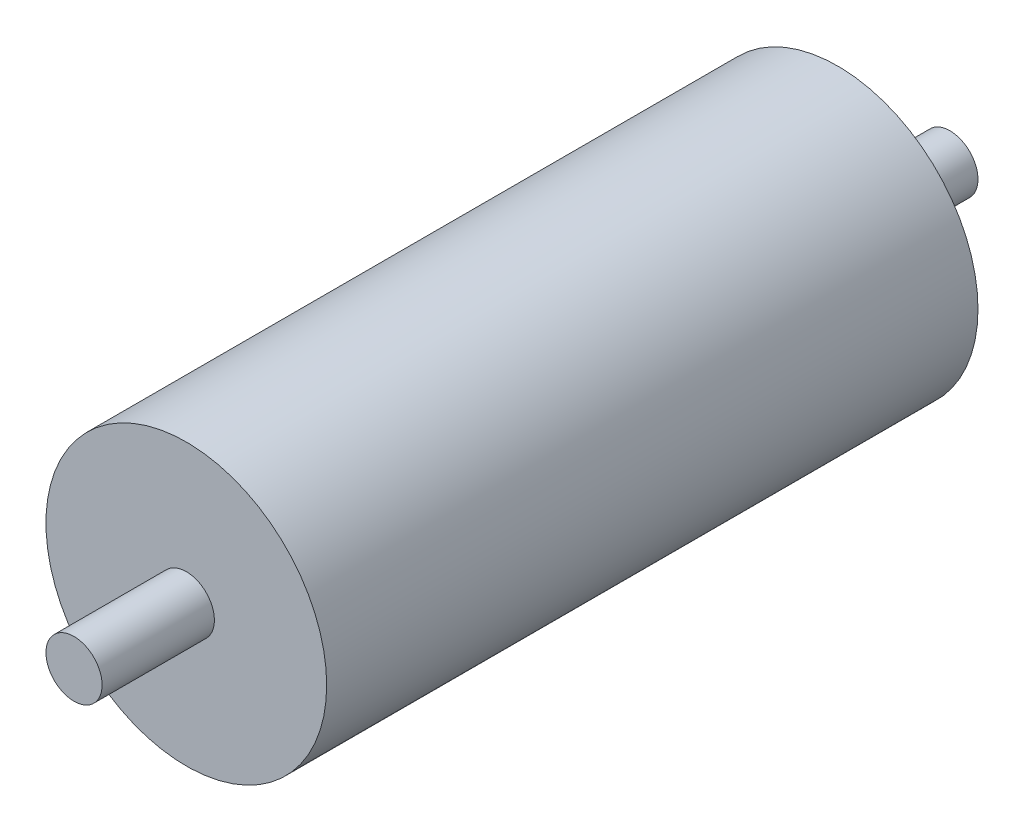
ISO-10303-21;
HEADER;
FILE_DESCRIPTION(('STEP AP214'),'2;1');
FILE_NAME('part.step','',(''),(''),'','','');
FILE_SCHEMA(('AUTOMOTIVE_DESIGN { 1 0 10303 214 1 1 1 1 }'));
ENDSEC;
DATA;
#1=APPLICATION_CONTEXT('core data for automotive mechanical design processes');
#2=APPLICATION_PROTOCOL_DEFINITION('international standard','automotive_design',2000,#1);
#3=PRODUCT_CONTEXT('',#1,'mechanical');
#4=PRODUCT('Part','Part','',(#3));
#5=PRODUCT_RELATED_PRODUCT_CATEGORY('part','',(#4));
#6=PRODUCT_DEFINITION_FORMATION('','',#4);
#7=PRODUCT_DEFINITION_CONTEXT('part definition',#1,'design');
#8=PRODUCT_DEFINITION('design','',#6,#7);
#9=PRODUCT_DEFINITION_SHAPE('','',#8);
#10=(LENGTH_UNIT() NAMED_UNIT(*) SI_UNIT(.MILLI.,.METRE.));
#11=(NAMED_UNIT(*) PLANE_ANGLE_UNIT() SI_UNIT($,.RADIAN.));
#12=(NAMED_UNIT(*) SI_UNIT($,.STERADIAN.) SOLID_ANGLE_UNIT());
#13=UNCERTAINTY_MEASURE_WITH_UNIT(LENGTH_MEASURE(1.E-05),#10,'distance_accuracy_value','');
#14=(GEOMETRIC_REPRESENTATION_CONTEXT(3) GLOBAL_UNCERTAINTY_ASSIGNED_CONTEXT((#13)) GLOBAL_UNIT_ASSIGNED_CONTEXT((#10,
#11,#12)) REPRESENTATION_CONTEXT('',''));
#15=CARTESIAN_POINT('',(0.,0.,0.));
#16=DIRECTION('',(0.,0.,1.));
#17=DIRECTION('',(1.,0.,0.));
#18=AXIS2_PLACEMENT_3D('',#15,#16,#17);
#19=CARTESIAN_POINT('',(0.,0.,58.));
#20=DIRECTION('',(0.,0.,-1.));
#21=DIRECTION('',(-1.,0.,0.));
#22=AXIS2_PLACEMENT_3D('',#19,#20,#21);
#23=CYLINDRICAL_SURFACE('',#22,12.5);
#24=CARTESIAN_POINT('',(0.,0.,58.));
#25=DIRECTION('',(0.,0.,1.));
#26=DIRECTION('',(1.,0.,0.));
#27=AXIS2_PLACEMENT_3D('',#24,#25,#26);
#28=CIRCLE('',#27,12.5);
#29=CARTESIAN_POINT('',(12.5,0.,58.));
#30=VERTEX_POINT('',#29);
#31=EDGE_CURVE('E43',#30,#30,#28,.T.);
#32=ORIENTED_EDGE('',*,*,#31,.F.);
#33=EDGE_LOOP('',(#32));
#34=FACE_BOUND('',#33,.T.);
#35=CARTESIAN_POINT('',(0.,0.,0.));
#36=DIRECTION('',(0.,0.,1.));
#37=DIRECTION('',(1.,0.,0.));
#38=AXIS2_PLACEMENT_3D('',#35,#36,#37);
#39=CIRCLE('',#38,12.5);
#40=CARTESIAN_POINT('',(12.5,0.,0.));
#41=VERTEX_POINT('',#40);
#42=EDGE_CURVE('E34',#41,#41,#39,.T.);
#43=ORIENTED_EDGE('',*,*,#42,.T.);
#44=EDGE_LOOP('',(#43));
#45=FACE_BOUND('',#44,.T.);
#46=ADVANCED_FACE('F31',(#34,#45),#23,.T.);
#47=CARTESIAN_POINT('',(0.,0.,58.));
#48=DIRECTION('',(0.,0.,1.));
#49=DIRECTION('',(1.,0.,0.));
#50=AXIS2_PLACEMENT_3D('',#47,#48,#49);
#51=PLANE('',#50);
#52=CARTESIAN_POINT('',(0.,0.,58.));
#53=DIRECTION('',(0.,0.,1.));
#54=DIRECTION('',(1.,0.,0.));
#55=AXIS2_PLACEMENT_3D('',#52,#53,#54);
#56=CIRCLE('',#55,2.5);
#57=CARTESIAN_POINT('',(2.5,0.,58.));
#58=VERTEX_POINT('',#57);
#59=EDGE_CURVE('E38',#58,#58,#56,.T.);
#60=ORIENTED_EDGE('',*,*,#59,.F.);
#61=EDGE_LOOP('',(#60));
#62=FACE_BOUND('',#61,.T.);
#63=ORIENTED_EDGE('',*,*,#31,.T.);
#64=EDGE_LOOP('',(#63));
#65=FACE_BOUND('',#64,.T.);
#66=ADVANCED_FACE('F60',(#62,#65),#51,.T.);
#67=CARTESIAN_POINT('',(0.,0.,0.));
#68=DIRECTION('',(0.,0.,1.));
#69=DIRECTION('',(1.,0.,0.));
#70=AXIS2_PLACEMENT_3D('',#67,#68,#69);
#71=PLANE('',#70);
#72=CARTESIAN_POINT('',(0.,0.,0.));
#73=DIRECTION('',(0.,0.,-1.));
#74=DIRECTION('',(-1.,0.,0.));
#75=AXIS2_PLACEMENT_3D('',#72,#73,#74);
#76=CIRCLE('',#75,2.5);
#77=CARTESIAN_POINT('',(-2.5,0.,0.));
#78=VERTEX_POINT('',#77);
#79=EDGE_CURVE('E10',#78,#78,#76,.T.);
#80=ORIENTED_EDGE('',*,*,#79,.F.);
#81=EDGE_LOOP('',(#80));
#82=FACE_BOUND('',#81,.T.);
#83=ORIENTED_EDGE('',*,*,#42,.F.);
#84=EDGE_LOOP('',(#83));
#85=FACE_BOUND('',#84,.T.);
#86=ADVANCED_FACE('F57',(#82,#85),#71,.F.);
#87=CARTESIAN_POINT('',(0.,0.,68.));
#88=DIRECTION('',(0.,0.,-1.));
#89=DIRECTION('',(-1.,0.,0.));
#90=AXIS2_PLACEMENT_3D('',#87,#88,#89);
#91=CYLINDRICAL_SURFACE('',#90,2.5);
#92=CARTESIAN_POINT('',(0.,0.,68.));
#93=DIRECTION('',(0.,0.,1.));
#94=DIRECTION('',(1.,0.,0.));
#95=AXIS2_PLACEMENT_3D('',#92,#93,#94);
#96=CIRCLE('',#95,2.5);
#97=CARTESIAN_POINT('',(2.5,0.,68.));
#98=VERTEX_POINT('',#97);
#99=EDGE_CURVE('E48',#98,#98,#96,.T.);
#100=ORIENTED_EDGE('',*,*,#99,.F.);
#101=EDGE_LOOP('',(#100));
#102=FACE_BOUND('',#101,.T.);
#103=ORIENTED_EDGE('',*,*,#59,.T.);
#104=EDGE_LOOP('',(#103));
#105=FACE_BOUND('',#104,.T.);
#106=ADVANCED_FACE('F59',(#102,#105),#91,.T.);
#107=CARTESIAN_POINT('',(0.,0.,68.));
#108=DIRECTION('',(0.,0.,1.));
#109=DIRECTION('',(1.,0.,0.));
#110=AXIS2_PLACEMENT_3D('',#107,#108,#109);
#111=PLANE('',#110);
#112=ORIENTED_EDGE('',*,*,#99,.T.);
#113=EDGE_LOOP('',(#112));
#114=FACE_BOUND('',#113,.T.);
#115=ADVANCED_FACE('F66',(#114),#111,.T.);
#116=CARTESIAN_POINT('',(0.,0.,-10.));
#117=DIRECTION('',(0.,0.,1.));
#118=DIRECTION('',(1.,0.,0.));
#119=AXIS2_PLACEMENT_3D('',#116,#117,#118);
#120=CYLINDRICAL_SURFACE('',#119,2.5);
#121=CARTESIAN_POINT('',(0.,0.,-10.));
#122=DIRECTION('',(0.,0.,-1.));
#123=DIRECTION('',(-1.,0.,0.));
#124=AXIS2_PLACEMENT_3D('',#121,#122,#123);
#125=CIRCLE('',#124,2.5);
#126=CARTESIAN_POINT('',(-2.5,0.,-10.));
#127=VERTEX_POINT('',#126);
#128=EDGE_CURVE('E47',#127,#127,#125,.T.);
#129=ORIENTED_EDGE('',*,*,#128,.F.);
#130=EDGE_LOOP('',(#129));
#131=FACE_BOUND('',#130,.T.);
#132=ORIENTED_EDGE('',*,*,#79,.T.);
#133=EDGE_LOOP('',(#132));
#134=FACE_BOUND('',#133,.T.);
#135=ADVANCED_FACE('F94',(#131,#134),#120,.T.);
#136=CARTESIAN_POINT('',(0.,0.,-10.));
#137=DIRECTION('',(0.,0.,-1.));
#138=DIRECTION('',(-1.,0.,0.));
#139=AXIS2_PLACEMENT_3D('',#136,#137,#138);
#140=PLANE('',#139);
#141=ORIENTED_EDGE('',*,*,#128,.T.);
#142=EDGE_LOOP('',(#141));
#143=FACE_BOUND('',#142,.T.);
#144=ADVANCED_FACE('F108',(#143),#140,.T.);
#145=CLOSED_SHELL('',(#46,#66,#86,#106,#115,#135,#144));
#146=MANIFOLD_SOLID_BREP('B2',#145);
#147=ADVANCED_BREP_SHAPE_REPRESENTATION('',(#18,#146),#14);
#148=SHAPE_DEFINITION_REPRESENTATION(#9,#147);
ENDSEC;
END-ISO-10303-21;
